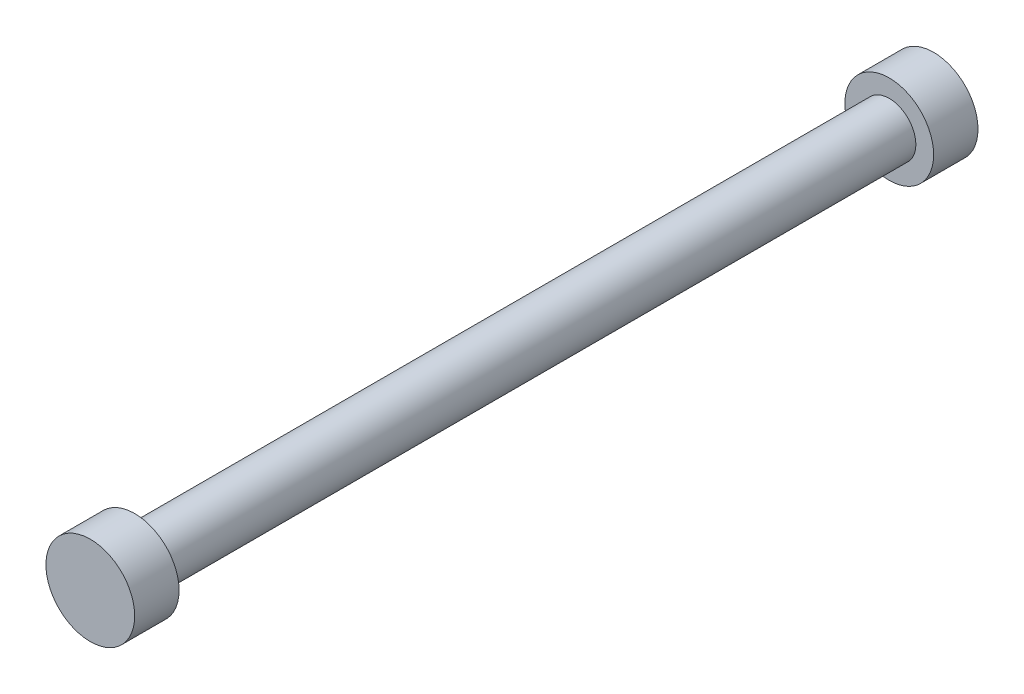
ISO-10303-21;
HEADER;
FILE_DESCRIPTION(('STEP AP214'),'2;1');
FILE_NAME('part.step','',(''),(''),'','','');
FILE_SCHEMA(('AUTOMOTIVE_DESIGN { 1 0 10303 214 1 1 1 1 }'));
ENDSEC;
DATA;
#1=APPLICATION_CONTEXT('core data for automotive mechanical design processes');
#2=APPLICATION_PROTOCOL_DEFINITION('international standard','automotive_design',2000,#1);
#3=PRODUCT_CONTEXT('',#1,'mechanical');
#4=PRODUCT('Part','Part','',(#3));
#5=PRODUCT_RELATED_PRODUCT_CATEGORY('part','',(#4));
#6=PRODUCT_DEFINITION_FORMATION('','',#4);
#7=PRODUCT_DEFINITION_CONTEXT('part definition',#1,'design');
#8=PRODUCT_DEFINITION('design','',#6,#7);
#9=PRODUCT_DEFINITION_SHAPE('','',#8);
#10=(LENGTH_UNIT() NAMED_UNIT(*) SI_UNIT(.MILLI.,.METRE.));
#11=(NAMED_UNIT(*) PLANE_ANGLE_UNIT() SI_UNIT($,.RADIAN.));
#12=(NAMED_UNIT(*) SI_UNIT($,.STERADIAN.) SOLID_ANGLE_UNIT());
#13=UNCERTAINTY_MEASURE_WITH_UNIT(LENGTH_MEASURE(1.E-05),#10,'distance_accuracy_value','');
#14=(GEOMETRIC_REPRESENTATION_CONTEXT(3) GLOBAL_UNCERTAINTY_ASSIGNED_CONTEXT((#13)) GLOBAL_UNIT_ASSIGNED_CONTEXT((#10,
#11,#12)) REPRESENTATION_CONTEXT('',''));
#15=CARTESIAN_POINT('',(0.,0.,0.));
#16=DIRECTION('',(0.,0.,1.));
#17=DIRECTION('',(1.,0.,0.));
#18=AXIS2_PLACEMENT_3D('',#15,#16,#17);
#19=CARTESIAN_POINT('',(0.,0.,42.5));
#20=DIRECTION('',(0.,0.,-1.));
#21=DIRECTION('',(-1.,0.,0.));
#22=AXIS2_PLACEMENT_3D('',#19,#20,#21);
#23=CYLINDRICAL_SURFACE('',#22,3.);
#24=CARTESIAN_POINT('',(0.,0.,42.5));
#25=DIRECTION('',(0.,0.,1.));
#26=DIRECTION('',(1.,0.,0.));
#27=AXIS2_PLACEMENT_3D('',#24,#25,#26);
#28=CIRCLE('',#27,3.);
#29=CARTESIAN_POINT('',(3.,0.,42.5));
#30=VERTEX_POINT('',#29);
#31=EDGE_CURVE('E10',#30,#30,#28,.T.);
#32=ORIENTED_EDGE('',*,*,#31,.F.);
#33=EDGE_LOOP('',(#32));
#34=FACE_BOUND('',#33,.T.);
#35=CARTESIAN_POINT('',(0.,0.,-42.5));
#36=DIRECTION('',(0.,0.,1.));
#37=DIRECTION('',(1.,0.,0.));
#38=AXIS2_PLACEMENT_3D('',#35,#36,#37);
#39=CIRCLE('',#38,3.);
#40=CARTESIAN_POINT('',(3.,0.,-42.5));
#41=VERTEX_POINT('',#40);
#42=EDGE_CURVE('E40',#41,#41,#39,.T.);
#43=ORIENTED_EDGE('',*,*,#42,.T.);
#44=EDGE_LOOP('',(#43));
#45=FACE_BOUND('',#44,.T.);
#46=ADVANCED_FACE('F37',(#34,#45),#23,.T.);
#47=CARTESIAN_POINT('',(0.,0.,47.5));
#48=DIRECTION('',(0.,0.,-1.));
#49=DIRECTION('',(-1.,0.,0.));
#50=AXIS2_PLACEMENT_3D('',#47,#48,#49);
#51=CYLINDRICAL_SURFACE('',#50,5.);
#52=CARTESIAN_POINT('',(0.,0.,47.5));
#53=DIRECTION('',(0.,0.,1.));
#54=DIRECTION('',(1.,0.,0.));
#55=AXIS2_PLACEMENT_3D('',#52,#53,#54);
#56=CIRCLE('',#55,5.);
#57=CARTESIAN_POINT('',(5.,0.,47.5));
#58=VERTEX_POINT('',#57);
#59=EDGE_CURVE('E45',#58,#58,#56,.T.);
#60=ORIENTED_EDGE('',*,*,#59,.F.);
#61=EDGE_LOOP('',(#60));
#62=FACE_BOUND('',#61,.T.);
#63=CARTESIAN_POINT('',(0.,0.,42.5));
#64=DIRECTION('',(0.,0.,1.));
#65=DIRECTION('',(1.,0.,0.));
#66=AXIS2_PLACEMENT_3D('',#63,#64,#65);
#67=CIRCLE('',#66,5.);
#68=CARTESIAN_POINT('',(5.,0.,42.5));
#69=VERTEX_POINT('',#68);
#70=EDGE_CURVE('E50',#69,#69,#67,.T.);
#71=ORIENTED_EDGE('',*,*,#70,.T.);
#72=EDGE_LOOP('',(#71));
#73=FACE_BOUND('',#72,.T.);
#74=ADVANCED_FACE('F91',(#62,#73),#51,.T.);
#75=CARTESIAN_POINT('',(0.,0.,47.5));
#76=DIRECTION('',(0.,0.,1.));
#77=DIRECTION('',(1.,0.,0.));
#78=AXIS2_PLACEMENT_3D('',#75,#76,#77);
#79=PLANE('',#78);
#80=ORIENTED_EDGE('',*,*,#59,.T.);
#81=EDGE_LOOP('',(#80));
#82=FACE_BOUND('',#81,.T.);
#83=ADVANCED_FACE('F87',(#82),#79,.T.);
#84=CARTESIAN_POINT('',(0.,0.,42.5));
#85=DIRECTION('',(0.,0.,1.));
#86=DIRECTION('',(1.,0.,0.));
#87=AXIS2_PLACEMENT_3D('',#84,#85,#86);
#88=PLANE('',#87);
#89=ORIENTED_EDGE('',*,*,#31,.T.);
#90=EDGE_LOOP('',(#89));
#91=FACE_BOUND('',#90,.T.);
#92=ORIENTED_EDGE('',*,*,#70,.F.);
#93=EDGE_LOOP('',(#92));
#94=FACE_BOUND('',#93,.T.);
#95=ADVANCED_FACE('F79',(#91,#94),#88,.F.);
#96=CARTESIAN_POINT('',(0.,0.,-47.5));
#97=DIRECTION('',(0.,0.,1.));
#98=DIRECTION('',(1.,0.,0.));
#99=AXIS2_PLACEMENT_3D('',#96,#97,#98);
#100=CYLINDRICAL_SURFACE('',#99,5.);
#101=CARTESIAN_POINT('',(0.,0.,-47.5));
#102=DIRECTION('',(0.,0.,1.));
#103=DIRECTION('',(1.,0.,0.));
#104=AXIS2_PLACEMENT_3D('',#101,#102,#103);
#105=CIRCLE('',#104,5.);
#106=CARTESIAN_POINT('',(5.,0.,-47.5));
#107=VERTEX_POINT('',#106);
#108=EDGE_CURVE('E60',#107,#107,#105,.T.);
#109=ORIENTED_EDGE('',*,*,#108,.T.);
#110=EDGE_LOOP('',(#109));
#111=FACE_BOUND('',#110,.T.);
#112=CARTESIAN_POINT('',(0.,0.,-42.5));
#113=DIRECTION('',(0.,0.,1.));
#114=DIRECTION('',(1.,0.,0.));
#115=AXIS2_PLACEMENT_3D('',#112,#113,#114);
#116=CIRCLE('',#115,5.);
#117=CARTESIAN_POINT('',(5.,0.,-42.5));
#118=VERTEX_POINT('',#117);
#119=EDGE_CURVE('E56',#118,#118,#116,.T.);
#120=ORIENTED_EDGE('',*,*,#119,.F.);
#121=EDGE_LOOP('',(#120));
#122=FACE_BOUND('',#121,.T.);
#123=ADVANCED_FACE('F77',(#111,#122),#100,.T.);
#124=CARTESIAN_POINT('',(0.,0.,-47.5));
#125=DIRECTION('',(0.,0.,-1.));
#126=DIRECTION('',(1.,0.,0.));
#127=AXIS2_PLACEMENT_3D('',#124,#125,#126);
#128=PLANE('',#127);
#129=ORIENTED_EDGE('',*,*,#108,.F.);
#130=EDGE_LOOP('',(#129));
#131=FACE_BOUND('',#130,.T.);
#132=ADVANCED_FACE('F73',(#131),#128,.T.);
#133=CARTESIAN_POINT('',(0.,0.,-42.5));
#134=DIRECTION('',(0.,0.,-1.));
#135=DIRECTION('',(1.,0.,0.));
#136=AXIS2_PLACEMENT_3D('',#133,#134,#135);
#137=PLANE('',#136);
#138=ORIENTED_EDGE('',*,*,#42,.F.);
#139=EDGE_LOOP('',(#138));
#140=FACE_BOUND('',#139,.T.);
#141=ORIENTED_EDGE('',*,*,#119,.T.);
#142=EDGE_LOOP('',(#141));
#143=FACE_BOUND('',#142,.T.);
#144=ADVANCED_FACE('F70',(#140,#143),#137,.F.);
#145=CLOSED_SHELL('',(#46,#74,#83,#95,#123,#132,#144));
#146=MANIFOLD_SOLID_BREP('B2',#145);
#147=ADVANCED_BREP_SHAPE_REPRESENTATION('',(#18,#146),#14);
#148=SHAPE_DEFINITION_REPRESENTATION(#9,#147);
ENDSEC;
END-ISO-10303-21;
